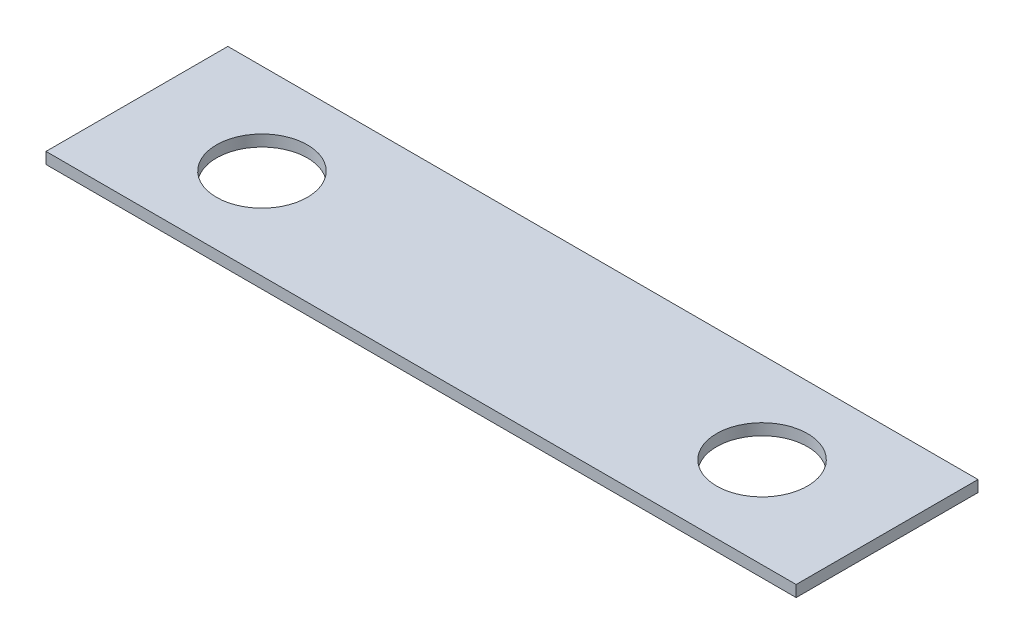
ISO-10303-21;
HEADER;
FILE_DESCRIPTION(('STEP AP214'),'2;1');
FILE_NAME('part.step','',(''),(''),'','','');
FILE_SCHEMA(('AUTOMOTIVE_DESIGN { 1 0 10303 214 1 1 1 1 }'));
ENDSEC;
DATA;
#1=APPLICATION_CONTEXT('core data for automotive mechanical design processes');
#2=APPLICATION_PROTOCOL_DEFINITION('international standard','automotive_design',2000,#1);
#3=PRODUCT_CONTEXT('',#1,'mechanical');
#4=PRODUCT('Part','Part','',(#3));
#5=PRODUCT_RELATED_PRODUCT_CATEGORY('part','',(#4));
#6=PRODUCT_DEFINITION_FORMATION('','',#4);
#7=PRODUCT_DEFINITION_CONTEXT('part definition',#1,'design');
#8=PRODUCT_DEFINITION('design','',#6,#7);
#9=PRODUCT_DEFINITION_SHAPE('','',#8);
#10=(LENGTH_UNIT() NAMED_UNIT(*) SI_UNIT(.MILLI.,.METRE.));
#11=(NAMED_UNIT(*) PLANE_ANGLE_UNIT() SI_UNIT($,.RADIAN.));
#12=(NAMED_UNIT(*) SI_UNIT($,.STERADIAN.) SOLID_ANGLE_UNIT());
#13=UNCERTAINTY_MEASURE_WITH_UNIT(LENGTH_MEASURE(1.E-05),#10,'distance_accuracy_value','');
#14=(GEOMETRIC_REPRESENTATION_CONTEXT(3) GLOBAL_UNCERTAINTY_ASSIGNED_CONTEXT((#13)) GLOBAL_UNIT_ASSIGNED_CONTEXT((#10,
#11,#12)) REPRESENTATION_CONTEXT('',''));
#15=CARTESIAN_POINT('',(0.,0.,0.));
#16=DIRECTION('',(0.,0.,1.));
#17=DIRECTION('',(1.,0.,0.));
#18=AXIS2_PLACEMENT_3D('',#15,#16,#17);
#19=CARTESIAN_POINT('',(0.,0.5,0.));
#20=DIRECTION('',(0.,-1.,0.));
#21=DIRECTION('',(0.,0.,-1.));
#22=AXIS2_PLACEMENT_3D('',#19,#20,#21);
#23=PLANE('',#22);
#24=DIRECTION('',(0.,0.,-1.));
#25=VECTOR('',#24,1.);
#26=CARTESIAN_POINT('',(16.5,0.5,4.));
#27=LINE('',#26,#25);
#28=CARTESIAN_POINT('',(16.5,0.5,4.));
#29=VERTEX_POINT('',#28);
#30=CARTESIAN_POINT('',(16.5,0.5,-4.));
#31=VERTEX_POINT('',#30);
#32=EDGE_CURVE('E88',#29,#31,#27,.T.);
#33=ORIENTED_EDGE('',*,*,#32,.T.);
#34=DIRECTION('',(-1.,0.,0.));
#35=VECTOR('',#34,1.);
#36=CARTESIAN_POINT('',(-16.5,0.5,-4.));
#37=LINE('',#36,#35);
#38=CARTESIAN_POINT('',(-16.5,0.5,-4.));
#39=VERTEX_POINT('',#38);
#40=EDGE_CURVE('E83',#31,#39,#37,.T.);
#41=ORIENTED_EDGE('',*,*,#40,.T.);
#42=DIRECTION('',(0.,0.,1.));
#43=VECTOR('',#42,1.);
#44=CARTESIAN_POINT('',(-16.5,0.5,4.));
#45=LINE('',#44,#43);
#46=CARTESIAN_POINT('',(-16.5,0.5,4.));
#47=VERTEX_POINT('',#46);
#48=EDGE_CURVE('E86',#39,#47,#45,.T.);
#49=ORIENTED_EDGE('',*,*,#48,.T.);
#50=DIRECTION('',(1.,0.,0.));
#51=VECTOR('',#50,1.);
#52=CARTESIAN_POINT('',(-16.5,0.5,4.));
#53=LINE('',#52,#51);
#54=EDGE_CURVE('E53',#47,#29,#53,.T.);
#55=ORIENTED_EDGE('',*,*,#54,.T.);
#56=EDGE_LOOP('',(#33,#41,#49,#55));
#57=FACE_BOUND('',#56,.T.);
#58=CARTESIAN_POINT('',(-11.,0.5,0.));
#59=DIRECTION('',(0.,1.,0.));
#60=DIRECTION('',(0.,0.,1.));
#61=AXIS2_PLACEMENT_3D('',#58,#59,#60);
#62=CIRCLE('',#61,2.);
#63=CARTESIAN_POINT('',(-11.,0.5,2.));
#64=VERTEX_POINT('',#63);
#65=EDGE_CURVE('E103',#64,#64,#62,.T.);
#66=ORIENTED_EDGE('',*,*,#65,.F.);
#67=EDGE_LOOP('',(#66));
#68=FACE_BOUND('',#67,.T.);
#69=CARTESIAN_POINT('',(11.,0.5,0.));
#70=DIRECTION('',(0.,1.,0.));
#71=DIRECTION('',(0.,0.,1.));
#72=AXIS2_PLACEMENT_3D('',#69,#70,#71);
#73=CIRCLE('',#72,2.);
#74=CARTESIAN_POINT('',(11.,0.5,2.));
#75=VERTEX_POINT('',#74);
#76=EDGE_CURVE('E118',#75,#75,#73,.T.);
#77=ORIENTED_EDGE('',*,*,#76,.F.);
#78=EDGE_LOOP('',(#77));
#79=FACE_BOUND('',#78,.T.);
#80=ADVANCED_FACE('F36',(#57,#68,#79),#23,.F.);
#81=CARTESIAN_POINT('',(0.,0.,0.));
#82=DIRECTION('',(0.,-1.,0.));
#83=DIRECTION('',(0.,0.,-1.));
#84=AXIS2_PLACEMENT_3D('',#81,#82,#83);
#85=PLANE('',#84);
#86=CARTESIAN_POINT('',(-11.,0.,0.));
#87=DIRECTION('',(0.,1.,0.));
#88=DIRECTION('',(0.,0.,1.));
#89=AXIS2_PLACEMENT_3D('',#86,#87,#88);
#90=CIRCLE('',#89,2.);
#91=CARTESIAN_POINT('',(-11.,0.,2.));
#92=VERTEX_POINT('',#91);
#93=EDGE_CURVE('E115',#92,#92,#90,.T.);
#94=ORIENTED_EDGE('',*,*,#93,.T.);
#95=EDGE_LOOP('',(#94));
#96=FACE_BOUND('',#95,.T.);
#97=DIRECTION('',(0.,0.,-1.));
#98=VECTOR('',#97,1.);
#99=CARTESIAN_POINT('',(16.5,0.,4.));
#100=LINE('',#99,#98);
#101=CARTESIAN_POINT('',(16.5,0.,4.));
#102=VERTEX_POINT('',#101);
#103=CARTESIAN_POINT('',(16.5,0.,-4.));
#104=VERTEX_POINT('',#103);
#105=EDGE_CURVE('E100',#102,#104,#100,.T.);
#106=ORIENTED_EDGE('',*,*,#105,.F.);
#107=DIRECTION('',(1.,0.,0.));
#108=VECTOR('',#107,1.);
#109=CARTESIAN_POINT('',(-16.5,0.,4.));
#110=LINE('',#109,#108);
#111=CARTESIAN_POINT('',(-16.5,0.,4.));
#112=VERTEX_POINT('',#111);
#113=EDGE_CURVE('E76',#112,#102,#110,.T.);
#114=ORIENTED_EDGE('',*,*,#113,.F.);
#115=DIRECTION('',(0.,0.,1.));
#116=VECTOR('',#115,1.);
#117=CARTESIAN_POINT('',(-16.5,0.,4.));
#118=LINE('',#117,#116);
#119=CARTESIAN_POINT('',(-16.5,0.,-4.));
#120=VERTEX_POINT('',#119);
#121=EDGE_CURVE('E70',#120,#112,#118,.T.);
#122=ORIENTED_EDGE('',*,*,#121,.F.);
#123=DIRECTION('',(-1.,0.,0.));
#124=VECTOR('',#123,1.);
#125=CARTESIAN_POINT('',(-16.5,0.,-4.));
#126=LINE('',#125,#124);
#127=EDGE_CURVE('E92',#104,#120,#126,.T.);
#128=ORIENTED_EDGE('',*,*,#127,.F.);
#129=EDGE_LOOP('',(#106,#114,#122,#128));
#130=FACE_BOUND('',#129,.T.);
#131=CARTESIAN_POINT('',(11.,0.,0.));
#132=DIRECTION('',(0.,1.,0.));
#133=DIRECTION('',(0.,0.,1.));
#134=AXIS2_PLACEMENT_3D('',#131,#132,#133);
#135=CIRCLE('',#134,2.);
#136=CARTESIAN_POINT('',(11.,0.,2.));
#137=VERTEX_POINT('',#136);
#138=EDGE_CURVE('E121',#137,#137,#135,.T.);
#139=ORIENTED_EDGE('',*,*,#138,.T.);
#140=EDGE_LOOP('',(#139));
#141=FACE_BOUND('',#140,.T.);
#142=ADVANCED_FACE('F111',(#96,#130,#141),#85,.T.);
#143=CARTESIAN_POINT('',(16.5,0.5,4.));
#144=DIRECTION('',(-1.,0.,0.));
#145=DIRECTION('',(0.,0.,1.));
#146=AXIS2_PLACEMENT_3D('',#143,#144,#145);
#147=PLANE('',#146);
#148=ORIENTED_EDGE('',*,*,#105,.T.);
#149=DIRECTION('',(0.,-1.,0.));
#150=VECTOR('',#149,1.);
#151=CARTESIAN_POINT('',(16.5,0.5,-4.));
#152=LINE('',#151,#150);
#153=EDGE_CURVE('E11',#31,#104,#152,.T.);
#154=ORIENTED_EDGE('',*,*,#153,.F.);
#155=ORIENTED_EDGE('',*,*,#32,.F.);
#156=DIRECTION('',(0.,-1.,0.));
#157=VECTOR('',#156,1.);
#158=CARTESIAN_POINT('',(16.5,0.5,4.));
#159=LINE('',#158,#157);
#160=EDGE_CURVE('E96',#29,#102,#159,.T.);
#161=ORIENTED_EDGE('',*,*,#160,.T.);
#162=EDGE_LOOP('',(#148,#154,#155,#161));
#163=FACE_BOUND('',#162,.T.);
#164=ADVANCED_FACE('F38',(#163),#147,.F.);
#165=CARTESIAN_POINT('',(-16.5,0.5,-4.));
#166=DIRECTION('',(0.,0.,1.));
#167=DIRECTION('',(1.,0.,0.));
#168=AXIS2_PLACEMENT_3D('',#165,#166,#167);
#169=PLANE('',#168);
#170=ORIENTED_EDGE('',*,*,#127,.T.);
#171=DIRECTION('',(0.,-1.,0.));
#172=VECTOR('',#171,1.);
#173=CARTESIAN_POINT('',(-16.5,0.5,-4.));
#174=LINE('',#173,#172);
#175=EDGE_CURVE('E45',#39,#120,#174,.T.);
#176=ORIENTED_EDGE('',*,*,#175,.F.);
#177=ORIENTED_EDGE('',*,*,#40,.F.);
#178=ORIENTED_EDGE('',*,*,#153,.T.);
#179=EDGE_LOOP('',(#170,#176,#177,#178));
#180=FACE_BOUND('',#179,.T.);
#181=ADVANCED_FACE('F91',(#180),#169,.F.);
#182=CARTESIAN_POINT('',(-16.5,0.5,4.));
#183=DIRECTION('',(1.,0.,0.));
#184=DIRECTION('',(0.,0.,-1.));
#185=AXIS2_PLACEMENT_3D('',#182,#183,#184);
#186=PLANE('',#185);
#187=ORIENTED_EDGE('',*,*,#121,.T.);
#188=DIRECTION('',(0.,-1.,0.));
#189=VECTOR('',#188,1.);
#190=CARTESIAN_POINT('',(-16.5,0.5,4.));
#191=LINE('',#190,#189);
#192=EDGE_CURVE('E93',#47,#112,#191,.T.);
#193=ORIENTED_EDGE('',*,*,#192,.F.);
#194=ORIENTED_EDGE('',*,*,#48,.F.);
#195=ORIENTED_EDGE('',*,*,#175,.T.);
#196=EDGE_LOOP('',(#187,#193,#194,#195));
#197=FACE_BOUND('',#196,.T.);
#198=ADVANCED_FACE('F94',(#197),#186,.F.);
#199=CARTESIAN_POINT('',(-16.5,0.5,4.));
#200=DIRECTION('',(0.,0.,-1.));
#201=DIRECTION('',(-1.,0.,0.));
#202=AXIS2_PLACEMENT_3D('',#199,#200,#201);
#203=PLANE('',#202);
#204=ORIENTED_EDGE('',*,*,#113,.T.);
#205=ORIENTED_EDGE('',*,*,#160,.F.);
#206=ORIENTED_EDGE('',*,*,#54,.F.);
#207=ORIENTED_EDGE('',*,*,#192,.T.);
#208=EDGE_LOOP('',(#204,#205,#206,#207));
#209=FACE_BOUND('',#208,.T.);
#210=ADVANCED_FACE('F108',(#209),#203,.F.);
#211=CARTESIAN_POINT('',(-11.,0.5,0.));
#212=DIRECTION('',(0.,-1.,0.));
#213=DIRECTION('',(0.,0.,-1.));
#214=AXIS2_PLACEMENT_3D('',#211,#212,#213);
#215=CYLINDRICAL_SURFACE('',#214,2.);
#216=ORIENTED_EDGE('',*,*,#65,.T.);
#217=EDGE_LOOP('',(#216));
#218=FACE_BOUND('',#217,.T.);
#219=ORIENTED_EDGE('',*,*,#93,.F.);
#220=EDGE_LOOP('',(#219));
#221=FACE_BOUND('',#220,.T.);
#222=ADVANCED_FACE('F138',(#218,#221),#215,.F.);
#223=CARTESIAN_POINT('',(11.,0.5,0.));
#224=DIRECTION('',(0.,-1.,0.));
#225=DIRECTION('',(0.,0.,-1.));
#226=AXIS2_PLACEMENT_3D('',#223,#224,#225);
#227=CYLINDRICAL_SURFACE('',#226,2.);
#228=ORIENTED_EDGE('',*,*,#76,.T.);
#229=EDGE_LOOP('',(#228));
#230=FACE_BOUND('',#229,.T.);
#231=ORIENTED_EDGE('',*,*,#138,.F.);
#232=EDGE_LOOP('',(#231));
#233=FACE_BOUND('',#232,.T.);
#234=ADVANCED_FACE('F127',(#230,#233),#227,.F.);
#235=CLOSED_SHELL('',(#80,#142,#164,#181,#198,#210,#222,#234));
#236=MANIFOLD_SOLID_BREP('B2',#235);
#237=ADVANCED_BREP_SHAPE_REPRESENTATION('',(#18,#236),#14);
#238=SHAPE_DEFINITION_REPRESENTATION(#9,#237);
ENDSEC;
END-ISO-10303-21;
